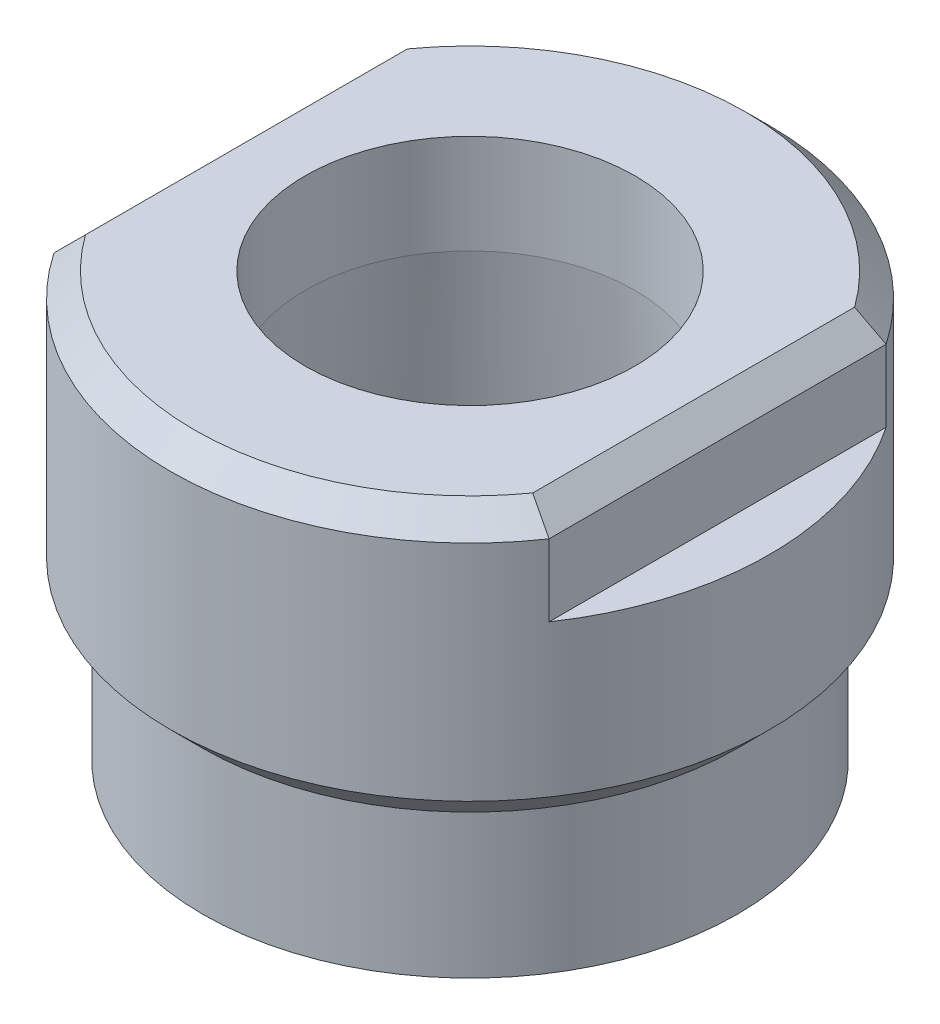
ISO-10303-21;
HEADER;
FILE_DESCRIPTION(('STEP AP214'),'2;1');
FILE_NAME('part.step','',(''),(''),'','','');
FILE_SCHEMA(('AUTOMOTIVE_DESIGN { 1 0 10303 214 1 1 1 1 }'));
ENDSEC;
DATA;
#1=APPLICATION_CONTEXT('core data for automotive mechanical design processes');
#2=APPLICATION_PROTOCOL_DEFINITION('international standard','automotive_design',2000,#1);
#3=PRODUCT_CONTEXT('',#1,'mechanical');
#4=PRODUCT('Part','Part','',(#3));
#5=PRODUCT_RELATED_PRODUCT_CATEGORY('part','',(#4));
#6=PRODUCT_DEFINITION_FORMATION('','',#4);
#7=PRODUCT_DEFINITION_CONTEXT('part definition',#1,'design');
#8=PRODUCT_DEFINITION('design','',#6,#7);
#9=PRODUCT_DEFINITION_SHAPE('','',#8);
#10=(LENGTH_UNIT() NAMED_UNIT(*) SI_UNIT(.MILLI.,.METRE.));
#11=(NAMED_UNIT(*) PLANE_ANGLE_UNIT() SI_UNIT($,.RADIAN.));
#12=(NAMED_UNIT(*) SI_UNIT($,.STERADIAN.) SOLID_ANGLE_UNIT());
#13=UNCERTAINTY_MEASURE_WITH_UNIT(LENGTH_MEASURE(1.E-05),#10,'distance_accuracy_value','');
#14=(GEOMETRIC_REPRESENTATION_CONTEXT(3) GLOBAL_UNCERTAINTY_ASSIGNED_CONTEXT((#13)) GLOBAL_UNIT_ASSIGNED_CONTEXT((#10,
#11,#12)) REPRESENTATION_CONTEXT('',''));
#15=CARTESIAN_POINT('',(0.,0.,0.));
#16=DIRECTION('',(0.,0.,1.));
#17=DIRECTION('',(1.,0.,0.));
#18=AXIS2_PLACEMENT_3D('',#15,#16,#17);
#19=CARTESIAN_POINT('',(0.,1.27,0.));
#20=DIRECTION('',(0.,-1.,0.));
#21=DIRECTION('',(0.,0.,-1.));
#22=AXIS2_PLACEMENT_3D('',#19,#20,#21);
#23=CONICAL_SURFACE('',#22,8.763,0.785398163397446);
#24=CARTESIAN_POINT('',(0.,1.27,0.));
#25=DIRECTION('',(0.,1.,0.));
#26=DIRECTION('',(0.,0.,1.));
#27=AXIS2_PLACEMENT_3D('',#24,#25,#26);
#28=CIRCLE('',#27,8.763);
#29=CARTESIAN_POINT('',(7.112,1.27,-5.11953367016959));
#30=VERTEX_POINT('',#29);
#31=CARTESIAN_POINT('',(-7.112,1.27,-5.11953367016959));
#32=VERTEX_POINT('',#31);
#33=EDGE_CURVE('E132',#30,#32,#28,.T.);
#34=ORIENTED_EDGE('',*,*,#33,.F.);
#35=CARTESIAN_POINT('',(7.112,1.27,-5.11953367016959));
#36=CARTESIAN_POINT('',(7.23886241881423,1.14313758118577,-5.16042497668843));
#37=CARTESIAN_POINT('',(7.36579364388557,1.01620635611443,-5.20087955833047));
#38=CARTESIAN_POINT('',(7.61979364395337,0.762206356046627,-5.28091525213903));
#39=CARTESIAN_POINT('',(7.74686241888202,0.635137581117983,-5.32049636473603));
#40=CARTESIAN_POINT('',(7.87399999999995,0.508000000000056,-5.35964075288668));
#41=B_SPLINE_CURVE_WITH_KNOTS('',3,(#35,#36,#37,#38,#39,#40),.UNSPECIFIED.,.F.,.F.,(4,2,4),(0.,
0.552029713646356,1.10405915523742),.UNSPECIFIED.);
#42=CARTESIAN_POINT('',(7.874,0.508000000000001,-5.35964075288634));
#43=VERTEX_POINT('',#42);
#44=EDGE_CURVE('E42',#30,#43,#41,.T.);
#45=ORIENTED_EDGE('',*,*,#44,.T.);
#46=CARTESIAN_POINT('',(0.,0.508,0.));
#47=DIRECTION('',(0.,1.,0.));
#48=DIRECTION('',(0.,0.,1.));
#49=AXIS2_PLACEMENT_3D('',#46,#47,#48);
#50=CIRCLE('',#49,9.525);
#51=CARTESIAN_POINT('',(-7.874,0.508,-5.35964075288634));
#52=VERTEX_POINT('',#51);
#53=EDGE_CURVE('E109',#43,#52,#50,.T.);
#54=ORIENTED_EDGE('',*,*,#53,.T.);
#55=CARTESIAN_POINT('',(-7.874,0.508000000000002,-5.35964075288634));
#56=CARTESIAN_POINT('',(-7.74686241888205,0.635137581117948,-5.32049636473581));
#57=CARTESIAN_POINT('',(-7.61979364395339,0.76220635604661,-5.28091525213893));
#58=CARTESIAN_POINT('',(-7.36579364388555,1.01620635611444,-5.20087955833057));
#59=CARTESIAN_POINT('',(-7.2388624188142,1.1431375811858,-5.16042497668864));
#60=CARTESIAN_POINT('',(-7.11199999999995,1.27000000000005,-5.11953367016989));
#61=B_SPLINE_CURVE_WITH_KNOTS('',3,(#55,#56,#57,#58,#59,#60),.UNSPECIFIED.,.F.,.F.,(4,2,4),(0.,
0.552029441591065,1.10405915523742),.UNSPECIFIED.);
#62=EDGE_CURVE('E49',#52,#32,#61,.T.);
#63=ORIENTED_EDGE('',*,*,#62,.T.);
#64=EDGE_LOOP('',(#34,#45,#54,#63));
#65=FACE_BOUND('',#64,.T.);
#66=ADVANCED_FACE('F34',(#65),#23,.T.);
#67=CARTESIAN_POINT('',(0.,-12.192,0.));
#68=DIRECTION('',(0.,-1.,0.));
#69=DIRECTION('',(0.,0.,-1.));
#70=AXIS2_PLACEMENT_3D('',#67,#68,#69);
#71=CONICAL_SURFACE('',#70,8.001,0.785398163397446);
#72=CARTESIAN_POINT('',(0.,-10.16,0.));
#73=DIRECTION('',(0.,1.,0.));
#74=DIRECTION('',(0.,0.,1.));
#75=AXIS2_PLACEMENT_3D('',#72,#73,#74);
#76=CIRCLE('',#75,5.96900000000001);
#77=CARTESIAN_POINT('',(0.,-10.16,5.96900000000001));
#78=VERTEX_POINT('',#77);
#79=EDGE_CURVE('E123',#78,#78,#76,.T.);
#80=ORIENTED_EDGE('',*,*,#79,.T.);
#81=EDGE_LOOP('',(#80));
#82=FACE_BOUND('',#81,.T.);
#83=CARTESIAN_POINT('',(0.,-12.192,0.));
#84=DIRECTION('',(0.,1.,0.));
#85=DIRECTION('',(0.,0.,1.));
#86=AXIS2_PLACEMENT_3D('',#83,#84,#85);
#87=CIRCLE('',#86,8.001);
#88=CARTESIAN_POINT('',(0.,-12.192,8.001));
#89=VERTEX_POINT('',#88);
#90=EDGE_CURVE('E147',#89,#89,#87,.T.);
#91=ORIENTED_EDGE('',*,*,#90,.F.);
#92=EDGE_LOOP('',(#91));
#93=FACE_BOUND('',#92,.T.);
#94=ADVANCED_FACE('F36',(#82,#93),#71,.F.);
#95=CARTESIAN_POINT('',(-8.001,-12.192,0.));
#96=DIRECTION('',(0.,-1.,0.));
#97=DIRECTION('',(0.,0.,-1.));
#98=AXIS2_PLACEMENT_3D('',#95,#96,#97);
#99=PLANE('',#98);
#100=ORIENTED_EDGE('',*,*,#90,.T.);
#101=EDGE_LOOP('',(#100));
#102=FACE_BOUND('',#101,.T.);
#103=CARTESIAN_POINT('',(0.,-12.192,0.));
#104=DIRECTION('',(0.,1.,0.));
#105=DIRECTION('',(0.,0.,1.));
#106=AXIS2_PLACEMENT_3D('',#103,#104,#105);
#107=CIRCLE('',#106,8.509);
#108=CARTESIAN_POINT('',(0.,-12.192,8.509));
#109=VERTEX_POINT('',#108);
#110=EDGE_CURVE('E144',#109,#109,#107,.T.);
#111=ORIENTED_EDGE('',*,*,#110,.F.);
#112=EDGE_LOOP('',(#111));
#113=FACE_BOUND('',#112,.T.);
#114=ADVANCED_FACE('F212',(#102,#113),#99,.T.);
#115=CARTESIAN_POINT('',(0.,0.,0.));
#116=DIRECTION('',(0.,1.,0.));
#117=DIRECTION('',(0.,0.,1.));
#118=AXIS2_PLACEMENT_3D('',#115,#116,#117);
#119=CYLINDRICAL_SURFACE('',#118,8.509);
#120=ORIENTED_EDGE('',*,*,#110,.T.);
#121=EDGE_LOOP('',(#120));
#122=FACE_BOUND('',#121,.T.);
#123=CARTESIAN_POINT('',(0.,-7.61999999999999,0.));
#124=DIRECTION('',(0.,1.,0.));
#125=DIRECTION('',(0.,0.,1.));
#126=AXIS2_PLACEMENT_3D('',#123,#124,#125);
#127=CIRCLE('',#126,8.509);
#128=CARTESIAN_POINT('',(0.,-7.61999999999999,8.509));
#129=VERTEX_POINT('',#128);
#130=EDGE_CURVE('E141',#129,#129,#127,.T.);
#131=ORIENTED_EDGE('',*,*,#130,.F.);
#132=EDGE_LOOP('',(#131));
#133=FACE_BOUND('',#132,.T.);
#134=ADVANCED_FACE('F225',(#122,#133),#119,.T.);
#135=CARTESIAN_POINT('',(0.,-6.604,0.));
#136=DIRECTION('',(0.,1.,0.));
#137=DIRECTION('',(0.,0.,1.));
#138=AXIS2_PLACEMENT_3D('',#135,#136,#137);
#139=CONICAL_SURFACE('',#138,9.525,0.785398163397451);
#140=ORIENTED_EDGE('',*,*,#130,.T.);
#141=EDGE_LOOP('',(#140));
#142=FACE_BOUND('',#141,.T.);
#143=CARTESIAN_POINT('',(0.,-6.604,0.));
#144=DIRECTION('',(0.,1.,0.));
#145=DIRECTION('',(0.,0.,1.));
#146=AXIS2_PLACEMENT_3D('',#143,#144,#145);
#147=CIRCLE('',#146,9.525);
#148=CARTESIAN_POINT('',(0.,-6.604,9.525));
#149=VERTEX_POINT('',#148);
#150=EDGE_CURVE('E138',#149,#149,#147,.T.);
#151=ORIENTED_EDGE('',*,*,#150,.F.);
#152=EDGE_LOOP('',(#151));
#153=FACE_BOUND('',#152,.T.);
#154=ADVANCED_FACE('F221',(#142,#153),#139,.T.);
#155=CARTESIAN_POINT('',(0.,0.,0.));
#156=DIRECTION('',(0.,1.,0.));
#157=DIRECTION('',(0.,0.,1.));
#158=AXIS2_PLACEMENT_3D('',#155,#156,#157);
#159=CYLINDRICAL_SURFACE('',#158,9.525);
#160=CARTESIAN_POINT('',(0.,-1.778,0.));
#161=DIRECTION('',(0.,-1.,0.));
#162=DIRECTION('',(1.,0.,0.));
#163=AXIS2_PLACEMENT_3D('',#160,#161,#162);
#164=CIRCLE('',#163,9.525);
#165=CARTESIAN_POINT('',(7.874,-1.778,5.35964075288634));
#166=VERTEX_POINT('',#165);
#167=CARTESIAN_POINT('',(7.874,-1.778,-5.35964075288634));
#168=VERTEX_POINT('',#167);
#169=EDGE_CURVE('E87',#166,#168,#164,.F.);
#170=ORIENTED_EDGE('',*,*,#169,.F.);
#171=DIRECTION('',(0.,1.,0.));
#172=VECTOR('',#171,1.);
#173=CARTESIAN_POINT('',(7.874,0.,5.35964075288634));
#174=LINE('',#173,#172);
#175=CARTESIAN_POINT('',(7.874,0.508,5.35964075288634));
#176=VERTEX_POINT('',#175);
#177=EDGE_CURVE('E104',#176,#166,#174,.F.);
#178=ORIENTED_EDGE('',*,*,#177,.F.);
#179=CARTESIAN_POINT('',(-7.874,0.508000000000001,5.35964075288634));
#180=VERTEX_POINT('',#179);
#181=EDGE_CURVE('E135',#180,#176,#50,.T.);
#182=ORIENTED_EDGE('',*,*,#181,.F.);
#183=DIRECTION('',(0.,1.,0.));
#184=VECTOR('',#183,1.);
#185=CARTESIAN_POINT('',(-7.874,0.,5.35964075288634));
#186=LINE('',#185,#184);
#187=CARTESIAN_POINT('',(-7.874,-1.778,5.35964075288634));
#188=VERTEX_POINT('',#187);
#189=EDGE_CURVE('E120',#188,#180,#186,.T.);
#190=ORIENTED_EDGE('',*,*,#189,.F.);
#191=CARTESIAN_POINT('',(0.,-1.778,0.));
#192=DIRECTION('',(0.,-1.,0.));
#193=DIRECTION('',(1.,0.,0.));
#194=AXIS2_PLACEMENT_3D('',#191,#192,#193);
#195=CIRCLE('',#194,9.525);
#196=CARTESIAN_POINT('',(-7.874,-1.778,-5.35964075288634));
#197=VERTEX_POINT('',#196);
#198=EDGE_CURVE('E96',#197,#188,#195,.F.);
#199=ORIENTED_EDGE('',*,*,#198,.F.);
#200=DIRECTION('',(0.,1.,0.));
#201=VECTOR('',#200,1.);
#202=CARTESIAN_POINT('',(-7.874,0.,-5.35964075288634));
#203=LINE('',#202,#201);
#204=EDGE_CURVE('E114',#52,#197,#203,.F.);
#205=ORIENTED_EDGE('',*,*,#204,.F.);
#206=ORIENTED_EDGE('',*,*,#53,.F.);
#207=DIRECTION('',(0.,1.,0.));
#208=VECTOR('',#207,1.);
#209=CARTESIAN_POINT('',(7.874,0.,-5.35964075288634));
#210=LINE('',#209,#208);
#211=EDGE_CURVE('E102',#168,#43,#210,.T.);
#212=ORIENTED_EDGE('',*,*,#211,.F.);
#213=EDGE_LOOP('',(#170,#178,#182,#190,#199,#205,#206,#212));
#214=FACE_BOUND('',#213,.T.);
#215=ORIENTED_EDGE('',*,*,#150,.T.);
#216=EDGE_LOOP('',(#215));
#217=FACE_BOUND('',#216,.T.);
#218=ADVANCED_FACE('F106',(#214,#217),#159,.T.);
#219=ORIENTED_EDGE('',*,*,#181,.T.);
#220=CARTESIAN_POINT('',(7.874,0.508000000000002,5.35964075288634));
#221=CARTESIAN_POINT('',(7.74686241888205,0.635137581117948,5.32049636473581));
#222=CARTESIAN_POINT('',(7.61979364395339,0.76220635604661,5.28091525213893));
#223=CARTESIAN_POINT('',(7.36579364388555,1.01620635611444,5.20087955833057));
#224=CARTESIAN_POINT('',(7.2388624188142,1.1431375811858,5.16042497668864));
#225=CARTESIAN_POINT('',(7.11199999999995,1.27000000000005,5.11953367016989));
#226=B_SPLINE_CURVE_WITH_KNOTS('',3,(#220,#221,#222,#223,#224,#225),.UNSPECIFIED.,.F.,.F.,(4,2,
4),(0.,0.552029441591065,1.10405915523742),.UNSPECIFIED.);
#227=CARTESIAN_POINT('',(7.112,1.27,5.11953367016959));
#228=VERTEX_POINT('',#227);
#229=EDGE_CURVE('E159',#176,#228,#226,.T.);
#230=ORIENTED_EDGE('',*,*,#229,.T.);
#231=CARTESIAN_POINT('',(-7.112,1.27,5.11953367016959));
#232=VERTEX_POINT('',#231);
#233=EDGE_CURVE('E134',#232,#228,#28,.T.);
#234=ORIENTED_EDGE('',*,*,#233,.F.);
#235=CARTESIAN_POINT('',(-7.112,1.27,5.11953367016959));
#236=CARTESIAN_POINT('',(-7.23886241881423,1.14313758118577,5.16042497668843));
#237=CARTESIAN_POINT('',(-7.36579364388557,1.01620635611443,5.20087955833047));
#238=CARTESIAN_POINT('',(-7.61979364395337,0.762206356046628,5.28091525213903));
#239=CARTESIAN_POINT('',(-7.74686241888202,0.635137581117983,5.32049636473603));
#240=CARTESIAN_POINT('',(-7.87399999999994,0.508000000000056,5.35964075288668));
#241=B_SPLINE_CURVE_WITH_KNOTS('',3,(#235,#236,#237,#238,#239,#240),.UNSPECIFIED.,.F.,.F.,(4,2,
4),(0.,0.552029713646355,1.10405915523742),.UNSPECIFIED.);
#242=EDGE_CURVE('E152',#232,#180,#241,.T.);
#243=ORIENTED_EDGE('',*,*,#242,.T.);
#244=EDGE_LOOP('',(#219,#230,#234,#243));
#245=FACE_BOUND('',#244,.T.);
#246=ADVANCED_FACE('F165',(#245),#23,.T.);
#247=CARTESIAN_POINT('',(-8.763,1.27,0.));
#248=DIRECTION('',(0.,1.,0.));
#249=DIRECTION('',(0.,0.,1.));
#250=AXIS2_PLACEMENT_3D('',#247,#248,#249);
#251=PLANE('',#250);
#252=ORIENTED_EDGE('',*,*,#233,.T.);
#253=DIRECTION('',(0.,0.,-1.));
#254=VECTOR('',#253,1.);
#255=CARTESIAN_POINT('',(7.112,1.27,-3.8458149981506));
#256=LINE('',#255,#254);
#257=EDGE_CURVE('E56',#228,#30,#256,.T.);
#258=ORIENTED_EDGE('',*,*,#257,.T.);
#259=ORIENTED_EDGE('',*,*,#33,.T.);
#260=DIRECTION('',(0.,0.,1.));
#261=VECTOR('',#260,1.);
#262=CARTESIAN_POINT('',(-7.112,1.27,3.8458149981506));
#263=LINE('',#262,#261);
#264=EDGE_CURVE('E346',#32,#232,#263,.T.);
#265=ORIENTED_EDGE('',*,*,#264,.T.);
#266=EDGE_LOOP('',(#252,#258,#259,#265));
#267=FACE_BOUND('',#266,.T.);
#268=CARTESIAN_POINT('',(0.,1.27,0.));
#269=DIRECTION('',(0.,1.,0.));
#270=DIRECTION('',(0.,0.,1.));
#271=AXIS2_PLACEMENT_3D('',#268,#269,#270);
#272=CIRCLE('',#271,5.2451);
#273=CARTESIAN_POINT('',(0.,1.27,5.2451));
#274=VERTEX_POINT('',#273);
#275=EDGE_CURVE('E129',#274,#274,#272,.T.);
#276=ORIENTED_EDGE('',*,*,#275,.F.);
#277=EDGE_LOOP('',(#276));
#278=FACE_BOUND('',#277,.T.);
#279=ADVANCED_FACE('F215',(#267,#278),#251,.T.);
#280=CARTESIAN_POINT('',(0.,0.,0.));
#281=DIRECTION('',(0.,1.,0.));
#282=DIRECTION('',(0.,0.,1.));
#283=AXIS2_PLACEMENT_3D('',#280,#281,#282);
#284=CYLINDRICAL_SURFACE('',#283,5.2451);
#285=ORIENTED_EDGE('',*,*,#275,.T.);
#286=EDGE_LOOP('',(#285));
#287=FACE_BOUND('',#286,.T.);
#288=CARTESIAN_POINT('',(0.,-1.88578513803095,0.));
#289=DIRECTION('',(0.,1.,0.));
#290=DIRECTION('',(0.,0.,1.));
#291=AXIS2_PLACEMENT_3D('',#288,#289,#290);
#292=CIRCLE('',#291,5.2451);
#293=CARTESIAN_POINT('',(0.,-1.88578513803095,5.2451));
#294=VERTEX_POINT('',#293);
#295=EDGE_CURVE('E126',#294,#294,#292,.T.);
#296=ORIENTED_EDGE('',*,*,#295,.F.);
#297=EDGE_LOOP('',(#296));
#298=FACE_BOUND('',#297,.T.);
#299=ADVANCED_FACE('F220',(#287,#298),#284,.F.);
#300=CARTESIAN_POINT('',(0.,-10.16,0.));
#301=DIRECTION('',(0.,-1.,0.));
#302=DIRECTION('',(0.,0.,-1.));
#303=AXIS2_PLACEMENT_3D('',#300,#301,#302);
#304=CONICAL_SURFACE('',#303,5.96900000000001,0.0872664625997165);
#305=ORIENTED_EDGE('',*,*,#295,.T.);
#306=EDGE_LOOP('',(#305));
#307=FACE_BOUND('',#306,.T.);
#308=ORIENTED_EDGE('',*,*,#79,.F.);
#309=EDGE_LOOP('',(#308));
#310=FACE_BOUND('',#309,.T.);
#311=ADVANCED_FACE('F205',(#307,#310),#304,.F.);
#312=CARTESIAN_POINT('',(-7.874,1.27,-9.525));
#313=DIRECTION('',(1.,0.,0.));
#314=DIRECTION('',(0.,0.,-1.));
#315=AXIS2_PLACEMENT_3D('',#312,#313,#314);
#316=PLANE('',#315);
#317=ORIENTED_EDGE('',*,*,#189,.T.);
#318=DIRECTION('',(0.,0.,-1.));
#319=VECTOR('',#318,1.);
#320=CARTESIAN_POINT('',(-7.874,0.508000000000002,-3.8458149981506));
#321=LINE('',#320,#319);
#322=EDGE_CURVE('E11',#180,#52,#321,.T.);
#323=ORIENTED_EDGE('',*,*,#322,.T.);
#324=ORIENTED_EDGE('',*,*,#204,.T.);
#325=DIRECTION('',(0.,0.,1.));
#326=VECTOR('',#325,1.);
#327=CARTESIAN_POINT('',(-7.874,-1.778,-9.525));
#328=LINE('',#327,#326);
#329=EDGE_CURVE('E111',#197,#188,#328,.T.);
#330=ORIENTED_EDGE('',*,*,#329,.T.);
#331=EDGE_LOOP('',(#317,#323,#324,#330));
#332=FACE_BOUND('',#331,.T.);
#333=ADVANCED_FACE('F195',(#332),#316,.F.);
#334=CARTESIAN_POINT('',(-7.874,-1.778,-9.525));
#335=DIRECTION('',(0.,-1.,0.));
#336=DIRECTION('',(1.,0.,0.));
#337=AXIS2_PLACEMENT_3D('',#334,#335,#336);
#338=PLANE('',#337);
#339=ORIENTED_EDGE('',*,*,#329,.F.);
#340=ORIENTED_EDGE('',*,*,#198,.T.);
#341=EDGE_LOOP('',(#339,#340));
#342=FACE_BOUND('',#341,.T.);
#343=ADVANCED_FACE('F198',(#342),#338,.F.);
#344=CARTESIAN_POINT('',(7.874,-1.778,-9.525));
#345=DIRECTION('',(0.,-1.,0.));
#346=DIRECTION('',(1.,0.,0.));
#347=AXIS2_PLACEMENT_3D('',#344,#345,#346);
#348=PLANE('',#347);
#349=ORIENTED_EDGE('',*,*,#169,.T.);
#350=DIRECTION('',(0.,0.,1.));
#351=VECTOR('',#350,1.);
#352=CARTESIAN_POINT('',(7.874,-1.778,-9.525));
#353=LINE('',#352,#351);
#354=EDGE_CURVE('E90',#168,#166,#353,.T.);
#355=ORIENTED_EDGE('',*,*,#354,.T.);
#356=EDGE_LOOP('',(#349,#355));
#357=FACE_BOUND('',#356,.T.);
#358=ADVANCED_FACE('F89',(#357),#348,.F.);
#359=CARTESIAN_POINT('',(7.874,1.27,-9.525));
#360=DIRECTION('',(-1.,0.,0.));
#361=DIRECTION('',(0.,0.,1.));
#362=AXIS2_PLACEMENT_3D('',#359,#360,#361);
#363=PLANE('',#362);
#364=ORIENTED_EDGE('',*,*,#211,.T.);
#365=DIRECTION('',(0.,0.,1.));
#366=VECTOR('',#365,1.);
#367=CARTESIAN_POINT('',(7.874,0.508000000000002,3.84581499815059));
#368=LINE('',#367,#366);
#369=EDGE_CURVE('E95',#43,#176,#368,.T.);
#370=ORIENTED_EDGE('',*,*,#369,.T.);
#371=ORIENTED_EDGE('',*,*,#177,.T.);
#372=ORIENTED_EDGE('',*,*,#354,.F.);
#373=EDGE_LOOP('',(#364,#370,#371,#372));
#374=FACE_BOUND('',#373,.T.);
#375=ADVANCED_FACE('F100',(#374),#363,.F.);
#376=CARTESIAN_POINT('',(7.874,0.508000000000002,-9.525));
#377=DIRECTION('',(0.707106781186546,0.707106781186549,0.));
#378=DIRECTION('',(-0.707106781186549,0.707106781186546,0.));
#379=AXIS2_PLACEMENT_3D('',#376,#377,#378);
#380=PLANE('',#379);
#381=ORIENTED_EDGE('',*,*,#44,.F.);
#382=ORIENTED_EDGE('',*,*,#257,.F.);
#383=ORIENTED_EDGE('',*,*,#229,.F.);
#384=ORIENTED_EDGE('',*,*,#369,.F.);
#385=EDGE_LOOP('',(#381,#382,#383,#384));
#386=FACE_BOUND('',#385,.T.);
#387=ADVANCED_FACE('F172',(#386),#380,.T.);
#388=CARTESIAN_POINT('',(-7.874,0.508000000000002,-9.525));
#389=DIRECTION('',(-0.707106781186546,0.707106781186549,0.));
#390=DIRECTION('',(-0.707106781186549,-0.707106781186546,0.));
#391=AXIS2_PLACEMENT_3D('',#388,#389,#390);
#392=PLANE('',#391);
#393=ORIENTED_EDGE('',*,*,#242,.F.);
#394=ORIENTED_EDGE('',*,*,#264,.F.);
#395=ORIENTED_EDGE('',*,*,#62,.F.);
#396=ORIENTED_EDGE('',*,*,#322,.F.);
#397=EDGE_LOOP('',(#393,#394,#395,#396));
#398=FACE_BOUND('',#397,.T.);
#399=ADVANCED_FACE('F169',(#398),#392,.T.);
#400=CLOSED_SHELL('',(#66,#94,#114,#134,#154,#218,#246,#279,#299,#311,#333,#343,#358,#375,#387,#399));
#401=MANIFOLD_SOLID_BREP('B2',#400);
#402=ADVANCED_BREP_SHAPE_REPRESENTATION('',(#18,#401),#14);
#403=SHAPE_DEFINITION_REPRESENTATION(#9,#402);
ENDSEC;
END-ISO-10303-21;
